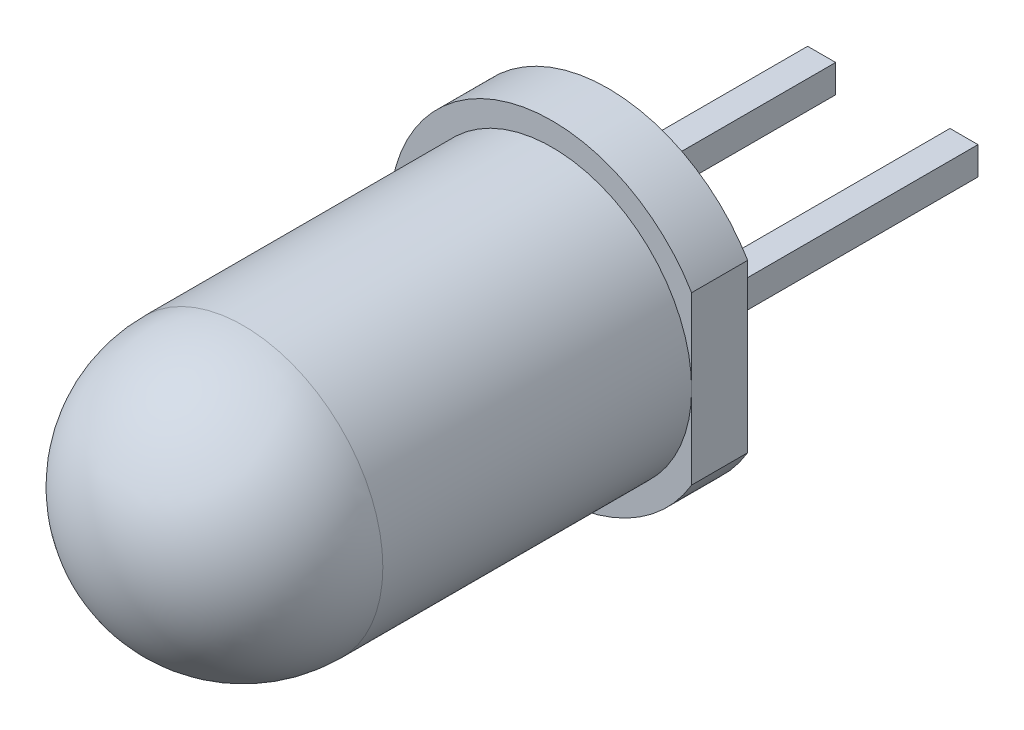
ISO-10303-21;
HEADER;
FILE_DESCRIPTION(('STEP AP214'),'2;1');
FILE_NAME('part.step','',(''),(''),'','','');
FILE_SCHEMA(('AUTOMOTIVE_DESIGN { 1 0 10303 214 1 1 1 1 }'));
ENDSEC;
DATA;
#1=APPLICATION_CONTEXT('core data for automotive mechanical design processes');
#2=APPLICATION_PROTOCOL_DEFINITION('international standard','automotive_design',2000,#1);
#3=PRODUCT_CONTEXT('',#1,'mechanical');
#4=PRODUCT('Part','Part','',(#3));
#5=PRODUCT_RELATED_PRODUCT_CATEGORY('part','',(#4));
#6=PRODUCT_DEFINITION_FORMATION('','',#4);
#7=PRODUCT_DEFINITION_CONTEXT('part definition',#1,'design');
#8=PRODUCT_DEFINITION('design','',#6,#7);
#9=PRODUCT_DEFINITION_SHAPE('','',#8);
#10=(LENGTH_UNIT() NAMED_UNIT(*) SI_UNIT(.MILLI.,.METRE.));
#11=(NAMED_UNIT(*) PLANE_ANGLE_UNIT() SI_UNIT($,.RADIAN.));
#12=(NAMED_UNIT(*) SI_UNIT($,.STERADIAN.) SOLID_ANGLE_UNIT());
#13=UNCERTAINTY_MEASURE_WITH_UNIT(LENGTH_MEASURE(1.E-05),#10,'distance_accuracy_value','');
#14=(GEOMETRIC_REPRESENTATION_CONTEXT(3) GLOBAL_UNCERTAINTY_ASSIGNED_CONTEXT((#13)) GLOBAL_UNIT_ASSIGNED_CONTEXT((#10,
#11,#12)) REPRESENTATION_CONTEXT('',''));
#15=CARTESIAN_POINT('',(0.,0.,0.));
#16=DIRECTION('',(0.,0.,1.));
#17=DIRECTION('',(1.,0.,0.));
#18=AXIS2_PLACEMENT_3D('',#15,#16,#17);
#19=CARTESIAN_POINT('',(-1.52,-0.250000000000004,-11.59));
#20=DIRECTION('',(1.,0.,0.));
#21=DIRECTION('',(0.,1.,0.));
#22=AXIS2_PLACEMENT_3D('',#19,#20,#21);
#23=PLANE('',#22);
#24=DIRECTION('',(0.,1.,0.));
#25=VECTOR('',#24,1.);
#26=CARTESIAN_POINT('',(-1.52,-0.250000000000004,-6.51));
#27=LINE('',#26,#25);
#28=CARTESIAN_POINT('',(-1.52,-0.250000000000004,-6.51));
#29=VERTEX_POINT('',#28);
#30=CARTESIAN_POINT('',(-1.52,0.25,-6.51));
#31=VERTEX_POINT('',#30);
#32=EDGE_CURVE('E104',#29,#31,#27,.T.);
#33=ORIENTED_EDGE('',*,*,#32,.T.);
#34=DIRECTION('',(0.,0.,1.));
#35=VECTOR('',#34,1.);
#36=CARTESIAN_POINT('',(-1.52,0.25,-11.59));
#37=LINE('',#36,#35);
#38=CARTESIAN_POINT('',(-1.52,0.25,-11.59));
#39=VERTEX_POINT('',#38);
#40=EDGE_CURVE('E12',#39,#31,#37,.T.);
#41=ORIENTED_EDGE('',*,*,#40,.F.);
#42=DIRECTION('',(0.,1.,0.));
#43=VECTOR('',#42,1.);
#44=CARTESIAN_POINT('',(-1.52,-0.250000000000004,-11.59));
#45=LINE('',#44,#43);
#46=CARTESIAN_POINT('',(-1.52,-0.250000000000004,-11.59));
#47=VERTEX_POINT('',#46);
#48=EDGE_CURVE('E92',#47,#39,#45,.T.);
#49=ORIENTED_EDGE('',*,*,#48,.F.);
#50=DIRECTION('',(0.,0.,1.));
#51=VECTOR('',#50,1.);
#52=CARTESIAN_POINT('',(-1.52,-0.250000000000004,-11.59));
#53=LINE('',#52,#51);
#54=EDGE_CURVE('E100',#47,#29,#53,.T.);
#55=ORIENTED_EDGE('',*,*,#54,.T.);
#56=EDGE_LOOP('',(#33,#41,#49,#55));
#57=FACE_BOUND('',#56,.T.);
#58=ADVANCED_FACE('F41',(#57),#23,.F.);
#59=CARTESIAN_POINT('',(-1.02,0.249999999999999,-11.59));
#60=DIRECTION('',(0.,-1.,0.));
#61=DIRECTION('',(1.,0.,0.));
#62=AXIS2_PLACEMENT_3D('',#59,#60,#61);
#63=PLANE('',#62);
#64=DIRECTION('',(1.,0.,0.));
#65=VECTOR('',#64,1.);
#66=CARTESIAN_POINT('',(-1.02,0.249999999999999,-6.51));
#67=LINE('',#66,#65);
#68=CARTESIAN_POINT('',(-1.02,0.249999999999999,-6.51));
#69=VERTEX_POINT('',#68);
#70=EDGE_CURVE('E96',#31,#69,#67,.T.);
#71=ORIENTED_EDGE('',*,*,#70,.T.);
#72=DIRECTION('',(0.,0.,1.));
#73=VECTOR('',#72,1.);
#74=CARTESIAN_POINT('',(-1.02,0.249999999999999,-11.59));
#75=LINE('',#74,#73);
#76=CARTESIAN_POINT('',(-1.02,0.249999999999999,-11.59));
#77=VERTEX_POINT('',#76);
#78=EDGE_CURVE('E49',#77,#69,#75,.T.);
#79=ORIENTED_EDGE('',*,*,#78,.F.);
#80=DIRECTION('',(1.,0.,0.));
#81=VECTOR('',#80,1.);
#82=CARTESIAN_POINT('',(-1.02,0.249999999999999,-11.59));
#83=LINE('',#82,#81);
#84=EDGE_CURVE('E87',#39,#77,#83,.T.);
#85=ORIENTED_EDGE('',*,*,#84,.F.);
#86=ORIENTED_EDGE('',*,*,#40,.T.);
#87=EDGE_LOOP('',(#71,#79,#85,#86));
#88=FACE_BOUND('',#87,.T.);
#89=ADVANCED_FACE('F95',(#88),#63,.F.);
#90=CARTESIAN_POINT('',(-1.02,-0.250000000000003,-11.59));
#91=DIRECTION('',(-1.,0.,0.));
#92=DIRECTION('',(0.,-1.,0.));
#93=AXIS2_PLACEMENT_3D('',#90,#91,#92);
#94=PLANE('',#93);
#95=DIRECTION('',(0.,-1.,0.));
#96=VECTOR('',#95,1.);
#97=CARTESIAN_POINT('',(-1.02,-0.250000000000003,-6.51));
#98=LINE('',#97,#96);
#99=CARTESIAN_POINT('',(-1.02,-0.250000000000003,-6.51));
#100=VERTEX_POINT('',#99);
#101=EDGE_CURVE('E74',#69,#100,#98,.T.);
#102=ORIENTED_EDGE('',*,*,#101,.T.);
#103=DIRECTION('',(0.,0.,1.));
#104=VECTOR('',#103,1.);
#105=CARTESIAN_POINT('',(-1.02,-0.250000000000003,-11.59));
#106=LINE('',#105,#104);
#107=CARTESIAN_POINT('',(-1.02,-0.250000000000003,-11.59));
#108=VERTEX_POINT('',#107);
#109=EDGE_CURVE('E97',#108,#100,#106,.T.);
#110=ORIENTED_EDGE('',*,*,#109,.F.);
#111=DIRECTION('',(0.,-1.,0.));
#112=VECTOR('',#111,1.);
#113=CARTESIAN_POINT('',(-1.02,-0.250000000000003,-11.59));
#114=LINE('',#113,#112);
#115=EDGE_CURVE('E90',#77,#108,#114,.T.);
#116=ORIENTED_EDGE('',*,*,#115,.F.);
#117=ORIENTED_EDGE('',*,*,#78,.T.);
#118=EDGE_LOOP('',(#102,#110,#116,#117));
#119=FACE_BOUND('',#118,.T.);
#120=ADVANCED_FACE('F98',(#119),#94,.F.);
#121=CARTESIAN_POINT('',(-1.02,-0.250000000000003,-11.59));
#122=DIRECTION('',(0.,1.,0.));
#123=DIRECTION('',(-1.,0.,0.));
#124=AXIS2_PLACEMENT_3D('',#121,#122,#123);
#125=PLANE('',#124);
#126=DIRECTION('',(-1.,0.,0.));
#127=VECTOR('',#126,1.);
#128=CARTESIAN_POINT('',(-1.02,-0.250000000000003,-6.51));
#129=LINE('',#128,#127);
#130=EDGE_CURVE('E80',#100,#29,#129,.T.);
#131=ORIENTED_EDGE('',*,*,#130,.T.);
#132=ORIENTED_EDGE('',*,*,#54,.F.);
#133=DIRECTION('',(-1.,0.,0.));
#134=VECTOR('',#133,1.);
#135=CARTESIAN_POINT('',(-1.02,-0.250000000000003,-11.59));
#136=LINE('',#135,#134);
#137=EDGE_CURVE('E57',#108,#47,#136,.T.);
#138=ORIENTED_EDGE('',*,*,#137,.F.);
#139=ORIENTED_EDGE('',*,*,#109,.T.);
#140=EDGE_LOOP('',(#131,#132,#138,#139));
#141=FACE_BOUND('',#140,.T.);
#142=ADVANCED_FACE('F111',(#141),#125,.F.);
#143=CARTESIAN_POINT('',(-1.52,0.25,-11.59));
#144=DIRECTION('',(0.,0.,1.));
#145=DIRECTION('',(1.,0.,0.));
#146=AXIS2_PLACEMENT_3D('',#143,#144,#145);
#147=PLANE('',#146);
#148=ORIENTED_EDGE('',*,*,#48,.T.);
#149=ORIENTED_EDGE('',*,*,#84,.T.);
#150=ORIENTED_EDGE('',*,*,#115,.T.);
#151=ORIENTED_EDGE('',*,*,#137,.T.);
#152=EDGE_LOOP('',(#148,#149,#150,#151));
#153=FACE_BOUND('',#152,.T.);
#154=ADVANCED_FACE('F88',(#153),#147,.F.);
#155=CARTESIAN_POINT('',(-1.52,0.25,-6.51));
#156=DIRECTION('',(0.,0.,1.));
#157=DIRECTION('',(1.,0.,0.));
#158=AXIS2_PLACEMENT_3D('',#155,#156,#157);
#159=PLANE('',#158);
#160=ORIENTED_EDGE('',*,*,#32,.F.);
#161=ORIENTED_EDGE('',*,*,#130,.F.);
#162=ORIENTED_EDGE('',*,*,#101,.F.);
#163=ORIENTED_EDGE('',*,*,#70,.F.);
#164=EDGE_LOOP('',(#160,#161,#162,#163));
#165=FACE_BOUND('',#164,.T.);
#166=ADVANCED_FACE('F114',(#165),#159,.T.);
#167=CLOSED_SHELL('',(#58,#89,#120,#142,#154,#166));
#168=MANIFOLD_SOLID_BREP('B2',#167);
#169=CARTESIAN_POINT('',(1.02,-0.250000000000001,-11.59));
#170=DIRECTION('',(1.,0.,0.));
#171=DIRECTION('',(0.,1.,0.));
#172=AXIS2_PLACEMENT_3D('',#169,#170,#171);
#173=PLANE('',#172);
#174=DIRECTION('',(0.,1.,0.));
#175=VECTOR('',#174,1.);
#176=CARTESIAN_POINT('',(1.02,-0.250000000000001,-6.51));
#177=LINE('',#176,#175);
#178=CARTESIAN_POINT('',(1.02,-0.250000000000001,-6.51));
#179=VERTEX_POINT('',#178);
#180=CARTESIAN_POINT('',(1.02,0.249999999999999,-6.51));
#181=VERTEX_POINT('',#180);
#182=EDGE_CURVE('E236',#179,#181,#177,.T.);
#183=ORIENTED_EDGE('',*,*,#182,.T.);
#184=DIRECTION('',(0.,0.,1.));
#185=VECTOR('',#184,1.);
#186=CARTESIAN_POINT('',(1.02,0.249999999999999,-11.59));
#187=LINE('',#186,#185);
#188=CARTESIAN_POINT('',(1.02,0.249999999999999,-11.59));
#189=VERTEX_POINT('',#188);
#190=EDGE_CURVE('E39',#189,#181,#187,.T.);
#191=ORIENTED_EDGE('',*,*,#190,.F.);
#192=DIRECTION('',(0.,1.,0.));
#193=VECTOR('',#192,1.);
#194=CARTESIAN_POINT('',(1.02,-0.250000000000001,-11.59));
#195=LINE('',#194,#193);
#196=CARTESIAN_POINT('',(1.02,-0.250000000000001,-11.59));
#197=VERTEX_POINT('',#196);
#198=EDGE_CURVE('E224',#197,#189,#195,.T.);
#199=ORIENTED_EDGE('',*,*,#198,.F.);
#200=DIRECTION('',(0.,0.,1.));
#201=VECTOR('',#200,1.);
#202=CARTESIAN_POINT('',(1.02,-0.250000000000001,-11.59));
#203=LINE('',#202,#201);
#204=EDGE_CURVE('E232',#197,#179,#203,.T.);
#205=ORIENTED_EDGE('',*,*,#204,.T.);
#206=EDGE_LOOP('',(#183,#191,#199,#205));
#207=FACE_BOUND('',#206,.T.);
#208=ADVANCED_FACE('F173',(#207),#173,.F.);
#209=CARTESIAN_POINT('',(1.52,0.249999999999999,-11.59));
#210=DIRECTION('',(0.,-1.,0.));
#211=DIRECTION('',(1.,0.,0.));
#212=AXIS2_PLACEMENT_3D('',#209,#210,#211);
#213=PLANE('',#212);
#214=DIRECTION('',(1.,0.,0.));
#215=VECTOR('',#214,1.);
#216=CARTESIAN_POINT('',(1.52,0.249999999999999,-6.51));
#217=LINE('',#216,#215);
#218=CARTESIAN_POINT('',(1.52,0.249999999999999,-6.51));
#219=VERTEX_POINT('',#218);
#220=EDGE_CURVE('E228',#181,#219,#217,.T.);
#221=ORIENTED_EDGE('',*,*,#220,.T.);
#222=DIRECTION('',(0.,0.,1.));
#223=VECTOR('',#222,1.);
#224=CARTESIAN_POINT('',(1.52,0.249999999999999,-11.59));
#225=LINE('',#224,#223);
#226=CARTESIAN_POINT('',(1.52,0.249999999999999,-11.59));
#227=VERTEX_POINT('',#226);
#228=EDGE_CURVE('E181',#227,#219,#225,.T.);
#229=ORIENTED_EDGE('',*,*,#228,.F.);
#230=DIRECTION('',(1.,0.,0.));
#231=VECTOR('',#230,1.);
#232=CARTESIAN_POINT('',(1.52,0.249999999999999,-11.59));
#233=LINE('',#232,#231);
#234=EDGE_CURVE('E219',#189,#227,#233,.T.);
#235=ORIENTED_EDGE('',*,*,#234,.F.);
#236=ORIENTED_EDGE('',*,*,#190,.T.);
#237=EDGE_LOOP('',(#221,#229,#235,#236));
#238=FACE_BOUND('',#237,.T.);
#239=ADVANCED_FACE('F227',(#238),#213,.F.);
#240=CARTESIAN_POINT('',(1.52,-0.250000000000001,-11.59));
#241=DIRECTION('',(-1.,0.,0.));
#242=DIRECTION('',(0.,0.,1.));
#243=AXIS2_PLACEMENT_3D('',#240,#241,#242);
#244=PLANE('',#243);
#245=DIRECTION('',(0.,-1.,0.));
#246=VECTOR('',#245,1.);
#247=CARTESIAN_POINT('',(1.52,-0.250000000000001,-6.51));
#248=LINE('',#247,#246);
#249=CARTESIAN_POINT('',(1.52,-0.250000000000001,-6.51));
#250=VERTEX_POINT('',#249);
#251=EDGE_CURVE('E206',#219,#250,#248,.T.);
#252=ORIENTED_EDGE('',*,*,#251,.T.);
#253=DIRECTION('',(0.,0.,1.));
#254=VECTOR('',#253,1.);
#255=CARTESIAN_POINT('',(1.52,-0.250000000000001,-11.59));
#256=LINE('',#255,#254);
#257=CARTESIAN_POINT('',(1.52,-0.250000000000001,-11.59));
#258=VERTEX_POINT('',#257);
#259=EDGE_CURVE('E229',#258,#250,#256,.T.);
#260=ORIENTED_EDGE('',*,*,#259,.F.);
#261=DIRECTION('',(0.,-1.,0.));
#262=VECTOR('',#261,1.);
#263=CARTESIAN_POINT('',(1.52,-0.250000000000001,-11.59));
#264=LINE('',#263,#262);
#265=EDGE_CURVE('E222',#227,#258,#264,.T.);
#266=ORIENTED_EDGE('',*,*,#265,.F.);
#267=ORIENTED_EDGE('',*,*,#228,.T.);
#268=EDGE_LOOP('',(#252,#260,#266,#267));
#269=FACE_BOUND('',#268,.T.);
#270=ADVANCED_FACE('F230',(#269),#244,.F.);
#271=CARTESIAN_POINT('',(1.52,-0.250000000000001,-11.59));
#272=DIRECTION('',(0.,1.,0.));
#273=DIRECTION('',(-1.,0.,0.));
#274=AXIS2_PLACEMENT_3D('',#271,#272,#273);
#275=PLANE('',#274);
#276=DIRECTION('',(-1.,0.,0.));
#277=VECTOR('',#276,1.);
#278=CARTESIAN_POINT('',(1.52,-0.250000000000001,-6.51));
#279=LINE('',#278,#277);
#280=EDGE_CURVE('E212',#250,#179,#279,.T.);
#281=ORIENTED_EDGE('',*,*,#280,.T.);
#282=ORIENTED_EDGE('',*,*,#204,.F.);
#283=DIRECTION('',(-1.,0.,0.));
#284=VECTOR('',#283,1.);
#285=CARTESIAN_POINT('',(1.52,-0.250000000000001,-11.59));
#286=LINE('',#285,#284);
#287=EDGE_CURVE('E189',#258,#197,#286,.T.);
#288=ORIENTED_EDGE('',*,*,#287,.F.);
#289=ORIENTED_EDGE('',*,*,#259,.T.);
#290=EDGE_LOOP('',(#281,#282,#288,#289));
#291=FACE_BOUND('',#290,.T.);
#292=ADVANCED_FACE('F243',(#291),#275,.F.);
#293=CARTESIAN_POINT('',(1.02,0.249999999999999,-11.59));
#294=DIRECTION('',(0.,0.,1.));
#295=DIRECTION('',(1.,0.,0.));
#296=AXIS2_PLACEMENT_3D('',#293,#294,#295);
#297=PLANE('',#296);
#298=ORIENTED_EDGE('',*,*,#198,.T.);
#299=ORIENTED_EDGE('',*,*,#234,.T.);
#300=ORIENTED_EDGE('',*,*,#265,.T.);
#301=ORIENTED_EDGE('',*,*,#287,.T.);
#302=EDGE_LOOP('',(#298,#299,#300,#301));
#303=FACE_BOUND('',#302,.T.);
#304=ADVANCED_FACE('F220',(#303),#297,.F.);
#305=CARTESIAN_POINT('',(1.02,0.249999999999999,-6.51));
#306=DIRECTION('',(0.,0.,1.));
#307=DIRECTION('',(1.,0.,0.));
#308=AXIS2_PLACEMENT_3D('',#305,#306,#307);
#309=PLANE('',#308);
#310=ORIENTED_EDGE('',*,*,#182,.F.);
#311=ORIENTED_EDGE('',*,*,#280,.F.);
#312=ORIENTED_EDGE('',*,*,#251,.F.);
#313=ORIENTED_EDGE('',*,*,#220,.F.);
#314=EDGE_LOOP('',(#310,#311,#312,#313));
#315=FACE_BOUND('',#314,.T.);
#316=ADVANCED_FACE('F246',(#315),#309,.T.);
#317=CLOSED_SHELL('',(#208,#239,#270,#292,#304,#316));
#318=MANIFOLD_SOLID_BREP('B6',#317);
#319=CARTESIAN_POINT('',(0.,0.,2.49));
#320=DIRECTION('',(0.,0.,1.));
#321=DIRECTION('',(1.,0.,0.));
#322=AXIS2_PLACEMENT_3D('',#319,#320,#321);
#323=CYLINDRICAL_SURFACE('',#322,2.49);
#324=CARTESIAN_POINT('',(0.,0.,0.));
#325=DIRECTION('',(0.,0.,1.));
#326=DIRECTION('',(1.,0.,0.));
#327=AXIS2_PLACEMENT_3D('',#324,#325,#326);
#328=CIRCLE('',#327,2.49);
#329=CARTESIAN_POINT('',(2.49,0.,0.));
#330=VERTEX_POINT('',#329);
#331=EDGE_CURVE('E304',#330,#330,#328,.T.);
#332=ORIENTED_EDGE('',*,*,#331,.F.);
#333=EDGE_LOOP('',(#332));
#334=FACE_BOUND('',#333,.T.);
#335=CARTESIAN_POINT('',(0.,0.,-5.51));
#336=DIRECTION('',(0.,0.,-1.));
#337=DIRECTION('',(-1.,0.,0.));
#338=AXIS2_PLACEMENT_3D('',#335,#336,#337);
#339=CIRCLE('',#338,2.49);
#340=CARTESIAN_POINT('',(2.49,0.,-5.51));
#341=VERTEX_POINT('',#340);
#342=EDGE_CURVE('E171',#341,#341,#339,.T.);
#343=ORIENTED_EDGE('',*,*,#342,.F.);
#344=EDGE_LOOP('',(#343));
#345=FACE_BOUND('',#344,.T.);
#346=ADVANCED_FACE('F296',(#334,#345),#323,.T.);
#347=CARTESIAN_POINT('',(0.,0.,0.));
#348=DIRECTION('',(0.,0.,1.));
#349=DIRECTION('',(-1.,0.,0.));
#350=AXIS2_PLACEMENT_3D('',#347,#348,#349);
#351=SPHERICAL_SURFACE('',#350,2.49);
#352=ORIENTED_EDGE('',*,*,#331,.T.);
#353=EDGE_LOOP('',(#352));
#354=FACE_BOUND('',#353,.T.);
#355=ADVANCED_FACE('F348',(#354),#351,.T.);
#356=CARTESIAN_POINT('',(2.49,1.48657324071167,-5.51));
#357=DIRECTION('',(1.,0.,0.));
#358=DIRECTION('',(0.,0.,-1.));
#359=AXIS2_PLACEMENT_3D('',#356,#357,#358);
#360=PLANE('',#359);
#361=DIRECTION('',(0.,-1.,0.));
#362=VECTOR('',#361,1.);
#363=CARTESIAN_POINT('',(2.49,1.48657324071167,-5.51));
#364=LINE('',#363,#362);
#365=CARTESIAN_POINT('',(2.49,1.48657324071167,-5.51));
#366=VERTEX_POINT('',#365);
#367=EDGE_CURVE('E342',#366,#341,#364,.T.);
#368=ORIENTED_EDGE('',*,*,#367,.T.);
#369=CARTESIAN_POINT('',(2.49,-1.48657324071167,-5.51));
#370=VERTEX_POINT('',#369);
#371=EDGE_CURVE('E315',#341,#370,#364,.T.);
#372=ORIENTED_EDGE('',*,*,#371,.T.);
#373=DIRECTION('',(0.,0.,-1.));
#374=VECTOR('',#373,1.);
#375=CARTESIAN_POINT('',(2.49,-1.48657324071167,-5.51));
#376=LINE('',#375,#374);
#377=CARTESIAN_POINT('',(2.49,-1.48657324071167,-6.51));
#378=VERTEX_POINT('',#377);
#379=EDGE_CURVE('E332',#370,#378,#376,.T.);
#380=ORIENTED_EDGE('',*,*,#379,.T.);
#381=DIRECTION('',(0.,-1.,0.));
#382=VECTOR('',#381,1.);
#383=CARTESIAN_POINT('',(2.49,1.48657324071167,-6.51));
#384=LINE('',#383,#382);
#385=CARTESIAN_POINT('',(2.49,1.48657324071167,-6.51));
#386=VERTEX_POINT('',#385);
#387=EDGE_CURVE('E327',#386,#378,#384,.T.);
#388=ORIENTED_EDGE('',*,*,#387,.F.);
#389=DIRECTION('',(0.,0.,-1.));
#390=VECTOR('',#389,1.);
#391=CARTESIAN_POINT('',(2.49,1.48657324071167,-5.51));
#392=LINE('',#391,#390);
#393=EDGE_CURVE('E337',#366,#386,#392,.T.);
#394=ORIENTED_EDGE('',*,*,#393,.F.);
#395=EDGE_LOOP('',(#368,#372,#380,#388,#394));
#396=FACE_BOUND('',#395,.T.);
#397=ADVANCED_FACE('F333',(#396),#360,.T.);
#398=CARTESIAN_POINT('',(0.,0.,-5.51));
#399=DIRECTION('',(0.,0.,-1.));
#400=DIRECTION('',(-1.,0.,0.));
#401=AXIS2_PLACEMENT_3D('',#398,#399,#400);
#402=PLANE('',#401);
#403=ORIENTED_EDGE('',*,*,#371,.F.);
#404=ORIENTED_EDGE('',*,*,#342,.T.);
#405=ORIENTED_EDGE('',*,*,#367,.F.);
#406=CARTESIAN_POINT('',(0.,0.,-5.51));
#407=DIRECTION('',(0.,0.,-1.));
#408=DIRECTION('',(-1.,0.,0.));
#409=AXIS2_PLACEMENT_3D('',#406,#407,#408);
#410=CIRCLE('',#409,2.9);
#411=EDGE_CURVE('E330',#370,#366,#410,.T.);
#412=ORIENTED_EDGE('',*,*,#411,.F.);
#413=EDGE_LOOP('',(#403,#404,#405,#412));
#414=FACE_BOUND('',#413,.T.);
#415=ADVANCED_FACE('F358',(#414),#402,.F.);
#416=CARTESIAN_POINT('',(0.,0.,-5.51));
#417=DIRECTION('',(0.,0.,-1.));
#418=DIRECTION('',(-1.,0.,0.));
#419=AXIS2_PLACEMENT_3D('',#416,#417,#418);
#420=CYLINDRICAL_SURFACE('',#419,2.9);
#421=CARTESIAN_POINT('',(0.,0.,-6.51));
#422=DIRECTION('',(0.,0.,-1.));
#423=DIRECTION('',(-1.,0.,0.));
#424=AXIS2_PLACEMENT_3D('',#421,#422,#423);
#425=CIRCLE('',#424,2.9);
#426=EDGE_CURVE('E329',#378,#386,#425,.T.);
#427=ORIENTED_EDGE('',*,*,#426,.F.);
#428=ORIENTED_EDGE('',*,*,#379,.F.);
#429=ORIENTED_EDGE('',*,*,#411,.T.);
#430=ORIENTED_EDGE('',*,*,#393,.T.);
#431=EDGE_LOOP('',(#427,#428,#429,#430));
#432=FACE_BOUND('',#431,.T.);
#433=ADVANCED_FACE('F339',(#432),#420,.T.);
#434=CARTESIAN_POINT('',(-2.49,0.,-6.51));
#435=DIRECTION('',(0.,0.,1.));
#436=DIRECTION('',(1.,0.,0.));
#437=AXIS2_PLACEMENT_3D('',#434,#435,#436);
#438=PLANE('',#437);
#439=ORIENTED_EDGE('',*,*,#387,.T.);
#440=ORIENTED_EDGE('',*,*,#426,.T.);
#441=EDGE_LOOP('',(#439,#440));
#442=FACE_BOUND('',#441,.T.);
#443=ADVANCED_FACE('F298',(#442),#438,.F.);
#444=CLOSED_SHELL('',(#346,#355,#397,#415,#433,#443));
#445=MANIFOLD_SOLID_BREP('B33',#444);
#446=ADVANCED_BREP_SHAPE_REPRESENTATION('',(#18,#168,#318,#445),#14);
#447=SHAPE_DEFINITION_REPRESENTATION(#9,#446);
ENDSEC;
END-ISO-10303-21;
